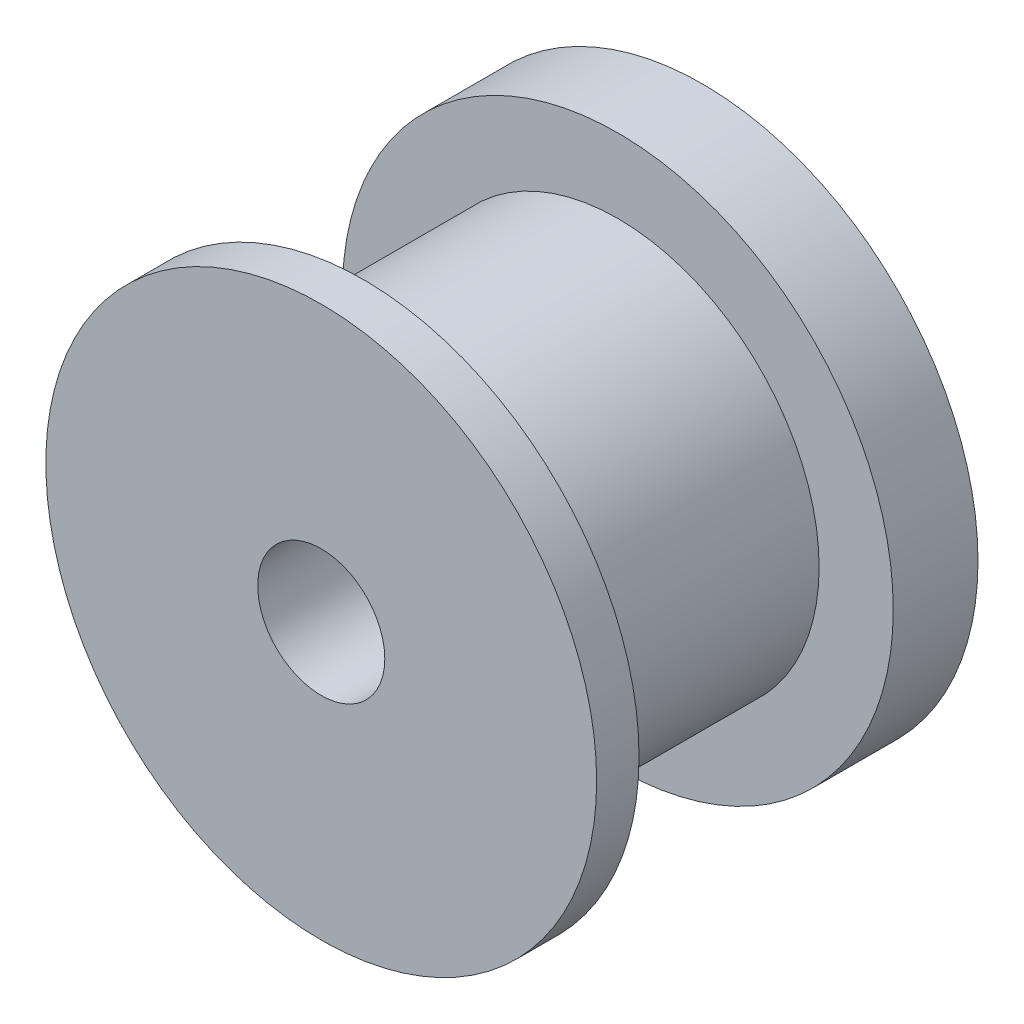
ISO-10303-21;
HEADER;
FILE_DESCRIPTION(('STEP AP214'),'2;1');
FILE_NAME('part.step','',(''),(''),'','','');
FILE_SCHEMA(('AUTOMOTIVE_DESIGN { 1 0 10303 214 1 1 1 1 }'));
ENDSEC;
DATA;
#1=APPLICATION_CONTEXT('core data for automotive mechanical design processes');
#2=APPLICATION_PROTOCOL_DEFINITION('international standard','automotive_design',2000,#1);
#3=PRODUCT_CONTEXT('',#1,'mechanical');
#4=PRODUCT('Part','Part','',(#3));
#5=PRODUCT_RELATED_PRODUCT_CATEGORY('part','',(#4));
#6=PRODUCT_DEFINITION_FORMATION('','',#4);
#7=PRODUCT_DEFINITION_CONTEXT('part definition',#1,'design');
#8=PRODUCT_DEFINITION('design','',#6,#7);
#9=PRODUCT_DEFINITION_SHAPE('','',#8);
#10=(LENGTH_UNIT() NAMED_UNIT(*) SI_UNIT(.MILLI.,.METRE.));
#11=(NAMED_UNIT(*) PLANE_ANGLE_UNIT() SI_UNIT($,.RADIAN.));
#12=(NAMED_UNIT(*) SI_UNIT($,.STERADIAN.) SOLID_ANGLE_UNIT());
#13=UNCERTAINTY_MEASURE_WITH_UNIT(LENGTH_MEASURE(1.E-05),#10,'distance_accuracy_value','');
#14=(GEOMETRIC_REPRESENTATION_CONTEXT(3) GLOBAL_UNCERTAINTY_ASSIGNED_CONTEXT((#13)) GLOBAL_UNIT_ASSIGNED_CONTEXT((#10,
#11,#12)) REPRESENTATION_CONTEXT('',''));
#15=CARTESIAN_POINT('',(0.,0.,0.));
#16=DIRECTION('',(0.,0.,1.));
#17=DIRECTION('',(1.,0.,0.));
#18=AXIS2_PLACEMENT_3D('',#15,#16,#17);
#19=CARTESIAN_POINT('',(0.,0.,2.));
#20=DIRECTION('',(0.,0.,-1.));
#21=DIRECTION('',(-1.,0.,0.));
#22=AXIS2_PLACEMENT_3D('',#19,#20,#21);
#23=CYLINDRICAL_SURFACE('',#22,6.5);
#24=CARTESIAN_POINT('',(0.,0.,2.));
#25=DIRECTION('',(0.,0.,1.));
#26=DIRECTION('',(1.,0.,0.));
#27=AXIS2_PLACEMENT_3D('',#24,#25,#26);
#28=CIRCLE('',#27,6.5);
#29=CARTESIAN_POINT('',(6.5,0.,2.));
#30=VERTEX_POINT('',#29);
#31=EDGE_CURVE('E45',#30,#30,#28,.T.);
#32=ORIENTED_EDGE('',*,*,#31,.F.);
#33=EDGE_LOOP('',(#32));
#34=FACE_BOUND('',#33,.T.);
#35=CARTESIAN_POINT('',(0.,0.,0.));
#36=DIRECTION('',(0.,0.,1.));
#37=DIRECTION('',(1.,0.,0.));
#38=AXIS2_PLACEMENT_3D('',#35,#36,#37);
#39=CIRCLE('',#38,6.5);
#40=CARTESIAN_POINT('',(6.5,0.,0.));
#41=VERTEX_POINT('',#40);
#42=EDGE_CURVE('E40',#41,#41,#39,.T.);
#43=ORIENTED_EDGE('',*,*,#42,.T.);
#44=EDGE_LOOP('',(#43));
#45=FACE_BOUND('',#44,.T.);
#46=ADVANCED_FACE('F37',(#34,#45),#23,.T.);
#47=CARTESIAN_POINT('',(0.,0.,2.));
#48=DIRECTION('',(0.,0.,1.));
#49=DIRECTION('',(1.,0.,0.));
#50=AXIS2_PLACEMENT_3D('',#47,#48,#49);
#51=PLANE('',#50);
#52=CARTESIAN_POINT('',(0.,0.,2.));
#53=DIRECTION('',(0.,0.,1.));
#54=DIRECTION('',(1.,0.,0.));
#55=AXIS2_PLACEMENT_3D('',#52,#53,#54);
#56=CIRCLE('',#55,4.75);
#57=CARTESIAN_POINT('',(4.75,0.,2.));
#58=VERTEX_POINT('',#57);
#59=EDGE_CURVE('E10',#58,#58,#56,.T.);
#60=ORIENTED_EDGE('',*,*,#59,.F.);
#61=EDGE_LOOP('',(#60));
#62=FACE_BOUND('',#61,.T.);
#63=ORIENTED_EDGE('',*,*,#31,.T.);
#64=EDGE_LOOP('',(#63));
#65=FACE_BOUND('',#64,.T.);
#66=ADVANCED_FACE('F102',(#62,#65),#51,.T.);
#67=CARTESIAN_POINT('',(0.,0.,0.));
#68=DIRECTION('',(0.,0.,1.));
#69=DIRECTION('',(1.,0.,0.));
#70=AXIS2_PLACEMENT_3D('',#67,#68,#69);
#71=PLANE('',#70);
#72=CARTESIAN_POINT('',(0.,0.,0.));
#73=DIRECTION('',(0.,0.,1.));
#74=DIRECTION('',(1.,0.,0.));
#75=AXIS2_PLACEMENT_3D('',#72,#73,#74);
#76=CIRCLE('',#75,1.5);
#77=CARTESIAN_POINT('',(1.5,0.,0.));
#78=VERTEX_POINT('',#77);
#79=EDGE_CURVE('E61',#78,#78,#76,.T.);
#80=ORIENTED_EDGE('',*,*,#79,.T.);
#81=EDGE_LOOP('',(#80));
#82=FACE_BOUND('',#81,.T.);
#83=ORIENTED_EDGE('',*,*,#42,.F.);
#84=EDGE_LOOP('',(#83));
#85=FACE_BOUND('',#84,.T.);
#86=ADVANCED_FACE('F73',(#82,#85),#71,.F.);
#87=CARTESIAN_POINT('',(0.,0.,8.));
#88=DIRECTION('',(0.,0.,-1.));
#89=DIRECTION('',(-1.,0.,0.));
#90=AXIS2_PLACEMENT_3D('',#87,#88,#89);
#91=CYLINDRICAL_SURFACE('',#90,4.75);
#92=CARTESIAN_POINT('',(0.,0.,8.));
#93=DIRECTION('',(0.,0.,1.));
#94=DIRECTION('',(1.,0.,0.));
#95=AXIS2_PLACEMENT_3D('',#92,#93,#94);
#96=CIRCLE('',#95,4.75);
#97=CARTESIAN_POINT('',(4.75,0.,8.));
#98=VERTEX_POINT('',#97);
#99=EDGE_CURVE('E52',#98,#98,#96,.T.);
#100=ORIENTED_EDGE('',*,*,#99,.F.);
#101=EDGE_LOOP('',(#100));
#102=FACE_BOUND('',#101,.T.);
#103=ORIENTED_EDGE('',*,*,#59,.T.);
#104=EDGE_LOOP('',(#103));
#105=FACE_BOUND('',#104,.T.);
#106=ADVANCED_FACE('F92',(#102,#105),#91,.T.);
#107=CARTESIAN_POINT('',(0.,0.,9.));
#108=DIRECTION('',(0.,0.,-1.));
#109=DIRECTION('',(-1.,0.,0.));
#110=AXIS2_PLACEMENT_3D('',#107,#108,#109);
#111=CYLINDRICAL_SURFACE('',#110,6.5);
#112=CARTESIAN_POINT('',(0.,0.,9.));
#113=DIRECTION('',(0.,0.,1.));
#114=DIRECTION('',(1.,0.,0.));
#115=AXIS2_PLACEMENT_3D('',#112,#113,#114);
#116=CIRCLE('',#115,6.5);
#117=CARTESIAN_POINT('',(6.5,0.,9.));
#118=VERTEX_POINT('',#117);
#119=EDGE_CURVE('E56',#118,#118,#116,.T.);
#120=ORIENTED_EDGE('',*,*,#119,.F.);
#121=EDGE_LOOP('',(#120));
#122=FACE_BOUND('',#121,.T.);
#123=CARTESIAN_POINT('',(0.,0.,8.));
#124=DIRECTION('',(0.,0.,1.));
#125=DIRECTION('',(1.,0.,0.));
#126=AXIS2_PLACEMENT_3D('',#123,#124,#125);
#127=CIRCLE('',#126,6.5);
#128=CARTESIAN_POINT('',(6.5,0.,8.));
#129=VERTEX_POINT('',#128);
#130=EDGE_CURVE('E57',#129,#129,#127,.T.);
#131=ORIENTED_EDGE('',*,*,#130,.T.);
#132=EDGE_LOOP('',(#131));
#133=FACE_BOUND('',#132,.T.);
#134=ADVANCED_FACE('F86',(#122,#133),#111,.T.);
#135=CARTESIAN_POINT('',(0.,0.,9.));
#136=DIRECTION('',(0.,0.,1.));
#137=DIRECTION('',(1.,0.,0.));
#138=AXIS2_PLACEMENT_3D('',#135,#136,#137);
#139=PLANE('',#138);
#140=CARTESIAN_POINT('',(0.,0.,9.));
#141=DIRECTION('',(0.,0.,1.));
#142=DIRECTION('',(1.,0.,0.));
#143=AXIS2_PLACEMENT_3D('',#140,#141,#142);
#144=CIRCLE('',#143,1.5);
#145=CARTESIAN_POINT('',(1.5,0.,9.));
#146=VERTEX_POINT('',#145);
#147=EDGE_CURVE('E65',#146,#146,#144,.T.);
#148=ORIENTED_EDGE('',*,*,#147,.F.);
#149=EDGE_LOOP('',(#148));
#150=FACE_BOUND('',#149,.T.);
#151=ORIENTED_EDGE('',*,*,#119,.T.);
#152=EDGE_LOOP('',(#151));
#153=FACE_BOUND('',#152,.T.);
#154=ADVANCED_FACE('F83',(#150,#153),#139,.T.);
#155=CARTESIAN_POINT('',(0.,0.,8.));
#156=DIRECTION('',(0.,0.,1.));
#157=DIRECTION('',(1.,0.,0.));
#158=AXIS2_PLACEMENT_3D('',#155,#156,#157);
#159=PLANE('',#158);
#160=ORIENTED_EDGE('',*,*,#99,.T.);
#161=EDGE_LOOP('',(#160));
#162=FACE_BOUND('',#161,.T.);
#163=ORIENTED_EDGE('',*,*,#130,.F.);
#164=EDGE_LOOP('',(#163));
#165=FACE_BOUND('',#164,.T.);
#166=ADVANCED_FACE('F79',(#162,#165),#159,.F.);
#167=CARTESIAN_POINT('',(0.,0.,0.));
#168=DIRECTION('',(0.,0.,1.));
#169=DIRECTION('',(1.,0.,0.));
#170=AXIS2_PLACEMENT_3D('',#167,#168,#169);
#171=CYLINDRICAL_SURFACE('',#170,1.5);
#172=ORIENTED_EDGE('',*,*,#79,.F.);
#173=EDGE_LOOP('',(#172));
#174=FACE_BOUND('',#173,.T.);
#175=ORIENTED_EDGE('',*,*,#147,.T.);
#176=EDGE_LOOP('',(#175));
#177=FACE_BOUND('',#176,.T.);
#178=ADVANCED_FACE('F76',(#174,#177),#171,.F.);
#179=CLOSED_SHELL('',(#46,#66,#86,#106,#134,#154,#166,#178));
#180=MANIFOLD_SOLID_BREP('B2',#179);
#181=ADVANCED_BREP_SHAPE_REPRESENTATION('',(#18,#180),#14);
#182=SHAPE_DEFINITION_REPRESENTATION(#9,#181);
ENDSEC;
END-ISO-10303-21;
